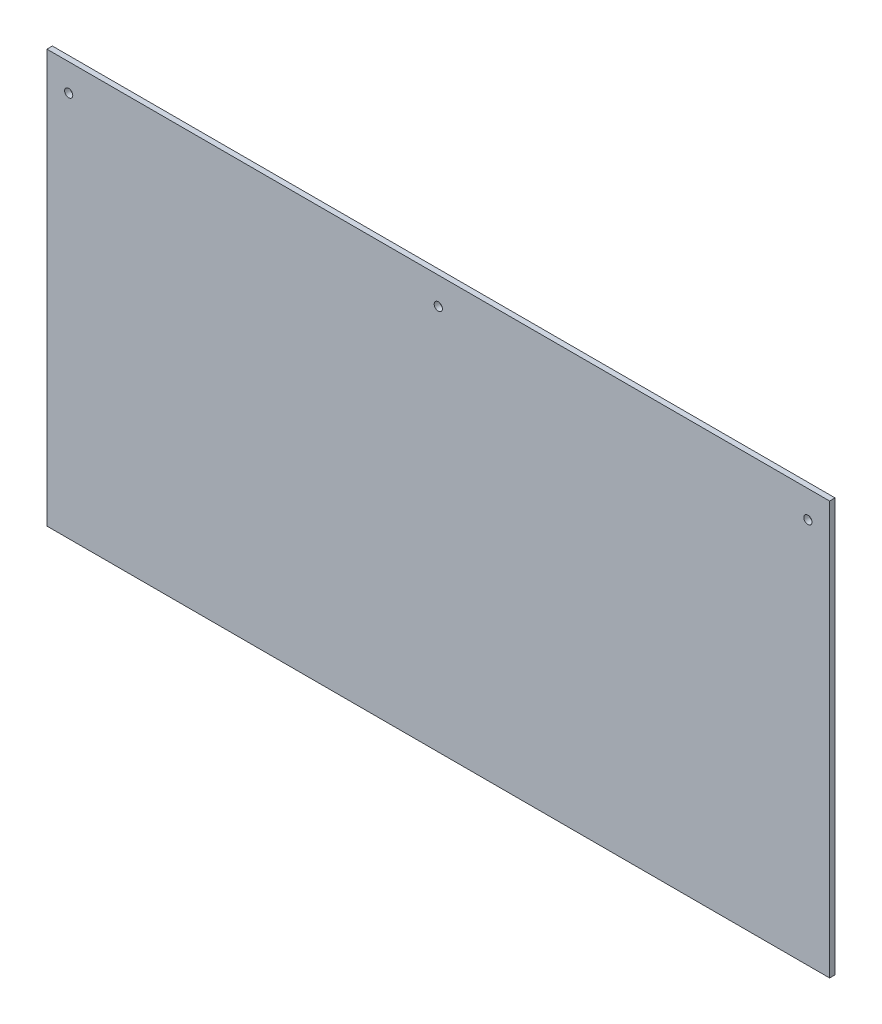
ISO-10303-21;
HEADER;
FILE_DESCRIPTION(('STEP AP214'),'2;1');
FILE_NAME('part.step','',(''),(''),'','','');
FILE_SCHEMA(('AUTOMOTIVE_DESIGN { 1 0 10303 214 1 1 1 1 }'));
ENDSEC;
DATA;
#1=APPLICATION_CONTEXT('core data for automotive mechanical design processes');
#2=APPLICATION_PROTOCOL_DEFINITION('international standard','automotive_design',2000,#1);
#3=PRODUCT_CONTEXT('',#1,'mechanical');
#4=PRODUCT('Part','Part','',(#3));
#5=PRODUCT_RELATED_PRODUCT_CATEGORY('part','',(#4));
#6=PRODUCT_DEFINITION_FORMATION('','',#4);
#7=PRODUCT_DEFINITION_CONTEXT('part definition',#1,'design');
#8=PRODUCT_DEFINITION('design','',#6,#7);
#9=PRODUCT_DEFINITION_SHAPE('','',#8);
#10=(LENGTH_UNIT() NAMED_UNIT(*) SI_UNIT(.MILLI.,.METRE.));
#11=(NAMED_UNIT(*) PLANE_ANGLE_UNIT() SI_UNIT($,.RADIAN.));
#12=(NAMED_UNIT(*) SI_UNIT($,.STERADIAN.) SOLID_ANGLE_UNIT());
#13=UNCERTAINTY_MEASURE_WITH_UNIT(LENGTH_MEASURE(1.E-05),#10,'distance_accuracy_value','');
#14=(GEOMETRIC_REPRESENTATION_CONTEXT(3) GLOBAL_UNCERTAINTY_ASSIGNED_CONTEXT((#13)) GLOBAL_UNIT_ASSIGNED_CONTEXT((#10,
#11,#12)) REPRESENTATION_CONTEXT('',''));
#15=CARTESIAN_POINT('',(0.,0.,0.));
#16=DIRECTION('',(0.,0.,1.));
#17=DIRECTION('',(1.,0.,0.));
#18=AXIS2_PLACEMENT_3D('',#15,#16,#17);
#19=CARTESIAN_POINT('',(889.,450.85,0.));
#20=DIRECTION('',(0.,0.,1.));
#21=DIRECTION('',(1.,0.,0.));
#22=AXIS2_PLACEMENT_3D('',#19,#20,#21);
#23=CYLINDRICAL_SURFACE('',#22,4.7625);
#24=CARTESIAN_POINT('',(889.,450.85,0.));
#25=DIRECTION('',(0.,0.,1.));
#26=DIRECTION('',(1.,0.,0.));
#27=AXIS2_PLACEMENT_3D('',#24,#25,#26);
#28=CIRCLE('',#27,4.7625);
#29=CARTESIAN_POINT('',(893.7625,450.85,0.));
#30=VERTEX_POINT('',#29);
#31=EDGE_CURVE('E45',#30,#30,#28,.T.);
#32=ORIENTED_EDGE('',*,*,#31,.F.);
#33=EDGE_LOOP('',(#32));
#34=FACE_BOUND('',#33,.T.);
#35=CARTESIAN_POINT('',(889.,450.85,6.35));
#36=DIRECTION('',(0.,0.,1.));
#37=DIRECTION('',(1.,0.,0.));
#38=AXIS2_PLACEMENT_3D('',#35,#36,#37);
#39=CIRCLE('',#38,4.7625);
#40=CARTESIAN_POINT('',(893.7625,450.85,6.35));
#41=VERTEX_POINT('',#40);
#42=EDGE_CURVE('E11',#41,#41,#39,.T.);
#43=ORIENTED_EDGE('',*,*,#42,.T.);
#44=EDGE_LOOP('',(#43));
#45=FACE_BOUND('',#44,.T.);
#46=ADVANCED_FACE('F37',(#34,#45),#23,.F.);
#47=CARTESIAN_POINT('',(0.,0.,6.35));
#48=DIRECTION('',(1.,0.,0.));
#49=DIRECTION('',(0.,0.,-1.));
#50=AXIS2_PLACEMENT_3D('',#47,#48,#49);
#51=PLANE('',#50);
#52=DIRECTION('',(0.,-1.,0.));
#53=VECTOR('',#52,1.);
#54=CARTESIAN_POINT('',(0.,0.,0.));
#55=LINE('',#54,#53);
#56=CARTESIAN_POINT('',(0.,482.6,0.));
#57=VERTEX_POINT('',#56);
#58=CARTESIAN_POINT('',(0.,0.,0.));
#59=VERTEX_POINT('',#58);
#60=EDGE_CURVE('E105',#57,#59,#55,.T.);
#61=ORIENTED_EDGE('',*,*,#60,.T.);
#62=DIRECTION('',(0.,0.,-1.));
#63=VECTOR('',#62,1.);
#64=CARTESIAN_POINT('',(0.,0.,6.35));
#65=LINE('',#64,#63);
#66=CARTESIAN_POINT('',(0.,0.,6.35));
#67=VERTEX_POINT('',#66);
#68=EDGE_CURVE('E96',#67,#59,#65,.T.);
#69=ORIENTED_EDGE('',*,*,#68,.F.);
#70=DIRECTION('',(0.,-1.,0.));
#71=VECTOR('',#70,1.);
#72=CARTESIAN_POINT('',(0.,0.,6.35));
#73=LINE('',#72,#71);
#74=CARTESIAN_POINT('',(0.,482.6,6.35));
#75=VERTEX_POINT('',#74);
#76=EDGE_CURVE('E90',#75,#67,#73,.T.);
#77=ORIENTED_EDGE('',*,*,#76,.F.);
#78=DIRECTION('',(0.,0.,-1.));
#79=VECTOR('',#78,1.);
#80=CARTESIAN_POINT('',(0.,482.6,6.35));
#81=LINE('',#80,#79);
#82=EDGE_CURVE('E101',#75,#57,#81,.T.);
#83=ORIENTED_EDGE('',*,*,#82,.T.);
#84=EDGE_LOOP('',(#61,#69,#77,#83));
#85=FACE_BOUND('',#84,.T.);
#86=ADVANCED_FACE('F121',(#85),#51,.F.);
#87=CARTESIAN_POINT('',(0.,0.,6.35));
#88=DIRECTION('',(0.,1.,0.));
#89=DIRECTION('',(0.,0.,1.));
#90=AXIS2_PLACEMENT_3D('',#87,#88,#89);
#91=PLANE('',#90);
#92=DIRECTION('',(1.,0.,0.));
#93=VECTOR('',#92,1.);
#94=CARTESIAN_POINT('',(0.,0.,0.));
#95=LINE('',#94,#93);
#96=CARTESIAN_POINT('',(914.4,0.,0.));
#97=VERTEX_POINT('',#96);
#98=EDGE_CURVE('E95',#59,#97,#95,.T.);
#99=ORIENTED_EDGE('',*,*,#98,.T.);
#100=DIRECTION('',(0.,0.,-1.));
#101=VECTOR('',#100,1.);
#102=CARTESIAN_POINT('',(914.4,0.,6.35));
#103=LINE('',#102,#101);
#104=CARTESIAN_POINT('',(914.4,0.,6.35));
#105=VERTEX_POINT('',#104);
#106=EDGE_CURVE('E93',#105,#97,#103,.T.);
#107=ORIENTED_EDGE('',*,*,#106,.F.);
#108=DIRECTION('',(1.,0.,0.));
#109=VECTOR('',#108,1.);
#110=CARTESIAN_POINT('',(0.,0.,6.35));
#111=LINE('',#110,#109);
#112=EDGE_CURVE('E84',#67,#105,#111,.T.);
#113=ORIENTED_EDGE('',*,*,#112,.F.);
#114=ORIENTED_EDGE('',*,*,#68,.T.);
#115=EDGE_LOOP('',(#99,#107,#113,#114));
#116=FACE_BOUND('',#115,.T.);
#117=ADVANCED_FACE('F94',(#116),#91,.F.);
#118=CARTESIAN_POINT('',(914.4,0.,6.35));
#119=DIRECTION('',(-1.,0.,0.));
#120=DIRECTION('',(0.,0.,1.));
#121=AXIS2_PLACEMENT_3D('',#118,#119,#120);
#122=PLANE('',#121);
#123=DIRECTION('',(0.,1.,0.));
#124=VECTOR('',#123,1.);
#125=CARTESIAN_POINT('',(914.4,0.,0.));
#126=LINE('',#125,#124);
#127=CARTESIAN_POINT('',(914.4,482.6,0.));
#128=VERTEX_POINT('',#127);
#129=EDGE_CURVE('E70',#97,#128,#126,.T.);
#130=ORIENTED_EDGE('',*,*,#129,.T.);
#131=DIRECTION('',(0.,0.,-1.));
#132=VECTOR('',#131,1.);
#133=CARTESIAN_POINT('',(914.4,482.6,6.35));
#134=LINE('',#133,#132);
#135=CARTESIAN_POINT('',(914.4,482.6,6.35));
#136=VERTEX_POINT('',#135);
#137=EDGE_CURVE('E97',#136,#128,#134,.T.);
#138=ORIENTED_EDGE('',*,*,#137,.F.);
#139=DIRECTION('',(0.,1.,0.));
#140=VECTOR('',#139,1.);
#141=CARTESIAN_POINT('',(914.4,0.,6.35));
#142=LINE('',#141,#140);
#143=EDGE_CURVE('E88',#105,#136,#142,.T.);
#144=ORIENTED_EDGE('',*,*,#143,.F.);
#145=ORIENTED_EDGE('',*,*,#106,.T.);
#146=EDGE_LOOP('',(#130,#138,#144,#145));
#147=FACE_BOUND('',#146,.T.);
#148=ADVANCED_FACE('F99',(#147),#122,.F.);
#149=CARTESIAN_POINT('',(0.,482.6,6.35));
#150=DIRECTION('',(0.,-1.,0.));
#151=DIRECTION('',(1.,0.,0.));
#152=AXIS2_PLACEMENT_3D('',#149,#150,#151);
#153=PLANE('',#152);
#154=DIRECTION('',(-1.,0.,0.));
#155=VECTOR('',#154,1.);
#156=CARTESIAN_POINT('',(0.,482.6,0.));
#157=LINE('',#156,#155);
#158=EDGE_CURVE('E76',#128,#57,#157,.T.);
#159=ORIENTED_EDGE('',*,*,#158,.T.);
#160=ORIENTED_EDGE('',*,*,#82,.F.);
#161=DIRECTION('',(-1.,0.,0.));
#162=VECTOR('',#161,1.);
#163=CARTESIAN_POINT('',(0.,482.6,6.35));
#164=LINE('',#163,#162);
#165=EDGE_CURVE('E53',#136,#75,#164,.T.);
#166=ORIENTED_EDGE('',*,*,#165,.F.);
#167=ORIENTED_EDGE('',*,*,#137,.T.);
#168=EDGE_LOOP('',(#159,#160,#166,#167));
#169=FACE_BOUND('',#168,.T.);
#170=ADVANCED_FACE('F124',(#169),#153,.F.);
#171=CARTESIAN_POINT('',(0.,0.,6.35));
#172=DIRECTION('',(0.,0.,-1.));
#173=DIRECTION('',(-1.,0.,0.));
#174=AXIS2_PLACEMENT_3D('',#171,#172,#173);
#175=PLANE('',#174);
#176=CARTESIAN_POINT('',(457.2,450.85,6.35));
#177=DIRECTION('',(0.,0.,1.));
#178=DIRECTION('',(1.,0.,0.));
#179=AXIS2_PLACEMENT_3D('',#176,#177,#178);
#180=CIRCLE('',#179,4.7625);
#181=CARTESIAN_POINT('',(461.9625,450.85,6.35));
#182=VERTEX_POINT('',#181);
#183=EDGE_CURVE('E153',#182,#182,#180,.T.);
#184=ORIENTED_EDGE('',*,*,#183,.F.);
#185=EDGE_LOOP('',(#184));
#186=FACE_BOUND('',#185,.T.);
#187=CARTESIAN_POINT('',(25.4,450.85,6.35));
#188=DIRECTION('',(0.,0.,1.));
#189=DIRECTION('',(1.,0.,0.));
#190=AXIS2_PLACEMENT_3D('',#187,#188,#189);
#191=CIRCLE('',#190,4.7625);
#192=CARTESIAN_POINT('',(30.1625,450.85,6.35));
#193=VERTEX_POINT('',#192);
#194=EDGE_CURVE('E150',#193,#193,#191,.T.);
#195=ORIENTED_EDGE('',*,*,#194,.F.);
#196=EDGE_LOOP('',(#195));
#197=FACE_BOUND('',#196,.T.);
#198=ORIENTED_EDGE('',*,*,#76,.T.);
#199=ORIENTED_EDGE('',*,*,#112,.T.);
#200=ORIENTED_EDGE('',*,*,#143,.T.);
#201=ORIENTED_EDGE('',*,*,#165,.T.);
#202=EDGE_LOOP('',(#198,#199,#200,#201));
#203=FACE_BOUND('',#202,.T.);
#204=ORIENTED_EDGE('',*,*,#42,.F.);
#205=EDGE_LOOP('',(#204));
#206=FACE_BOUND('',#205,.T.);
#207=ADVANCED_FACE('F85',(#186,#197,#203,#206),#175,.F.);
#208=CARTESIAN_POINT('',(0.,0.,0.));
#209=DIRECTION('',(0.,0.,-1.));
#210=DIRECTION('',(-1.,0.,0.));
#211=AXIS2_PLACEMENT_3D('',#208,#209,#210);
#212=PLANE('',#211);
#213=CARTESIAN_POINT('',(457.2,450.85,0.));
#214=DIRECTION('',(0.,0.,1.));
#215=DIRECTION('',(1.,0.,0.));
#216=AXIS2_PLACEMENT_3D('',#213,#214,#215);
#217=CIRCLE('',#216,4.7625);
#218=CARTESIAN_POINT('',(461.9625,450.85,0.));
#219=VERTEX_POINT('',#218);
#220=EDGE_CURVE('E158',#219,#219,#217,.T.);
#221=ORIENTED_EDGE('',*,*,#220,.T.);
#222=EDGE_LOOP('',(#221));
#223=FACE_BOUND('',#222,.T.);
#224=CARTESIAN_POINT('',(25.4,450.85,0.));
#225=DIRECTION('',(0.,0.,1.));
#226=DIRECTION('',(1.,0.,0.));
#227=AXIS2_PLACEMENT_3D('',#224,#225,#226);
#228=CIRCLE('',#227,4.7625);
#229=CARTESIAN_POINT('',(30.1625,450.85,0.));
#230=VERTEX_POINT('',#229);
#231=EDGE_CURVE('E108',#230,#230,#228,.T.);
#232=ORIENTED_EDGE('',*,*,#231,.T.);
#233=EDGE_LOOP('',(#232));
#234=FACE_BOUND('',#233,.T.);
#235=ORIENTED_EDGE('',*,*,#60,.F.);
#236=ORIENTED_EDGE('',*,*,#158,.F.);
#237=ORIENTED_EDGE('',*,*,#129,.F.);
#238=ORIENTED_EDGE('',*,*,#98,.F.);
#239=EDGE_LOOP('',(#235,#236,#237,#238));
#240=FACE_BOUND('',#239,.T.);
#241=ORIENTED_EDGE('',*,*,#31,.T.);
#242=EDGE_LOOP('',(#241));
#243=FACE_BOUND('',#242,.T.);
#244=ADVANCED_FACE('F117',(#223,#234,#240,#243),#212,.T.);
#245=CARTESIAN_POINT('',(25.4,450.85,0.));
#246=DIRECTION('',(0.,0.,1.));
#247=DIRECTION('',(1.,0.,0.));
#248=AXIS2_PLACEMENT_3D('',#245,#246,#247);
#249=CYLINDRICAL_SURFACE('',#248,4.7625);
#250=ORIENTED_EDGE('',*,*,#231,.F.);
#251=EDGE_LOOP('',(#250));
#252=FACE_BOUND('',#251,.T.);
#253=ORIENTED_EDGE('',*,*,#194,.T.);
#254=EDGE_LOOP('',(#253));
#255=FACE_BOUND('',#254,.T.);
#256=ADVANCED_FACE('F130',(#252,#255),#249,.F.);
#257=CARTESIAN_POINT('',(457.2,450.85,0.));
#258=DIRECTION('',(0.,0.,1.));
#259=DIRECTION('',(1.,0.,0.));
#260=AXIS2_PLACEMENT_3D('',#257,#258,#259);
#261=CYLINDRICAL_SURFACE('',#260,4.7625);
#262=ORIENTED_EDGE('',*,*,#220,.F.);
#263=EDGE_LOOP('',(#262));
#264=FACE_BOUND('',#263,.T.);
#265=ORIENTED_EDGE('',*,*,#183,.T.);
#266=EDGE_LOOP('',(#265));
#267=FACE_BOUND('',#266,.T.);
#268=ADVANCED_FACE('F163',(#264,#267),#261,.F.);
#269=CLOSED_SHELL('',(#46,#86,#117,#148,#170,#207,#244,#256,#268));
#270=MANIFOLD_SOLID_BREP('B2',#269);
#271=ADVANCED_BREP_SHAPE_REPRESENTATION('',(#18,#270),#14);
#272=SHAPE_DEFINITION_REPRESENTATION(#9,#271);
ENDSEC;
END-ISO-10303-21;
